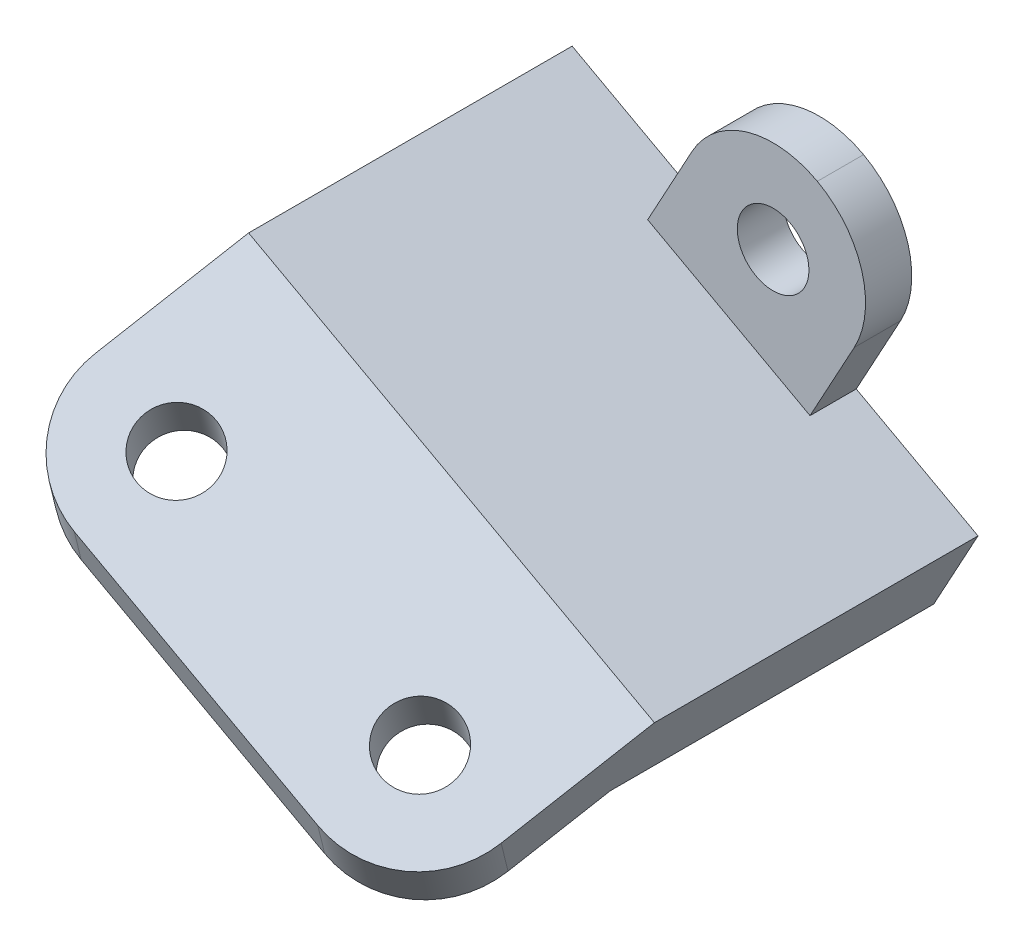
ISO-10303-21;
HEADER;
FILE_DESCRIPTION(('STEP AP214'),'2;1');
FILE_NAME('part.step','',(''),(''),'','','');
FILE_SCHEMA(('AUTOMOTIVE_DESIGN { 1 0 10303 214 1 1 1 1 }'));
ENDSEC;
DATA;
#1=APPLICATION_CONTEXT('core data for automotive mechanical design processes');
#2=APPLICATION_PROTOCOL_DEFINITION('international standard','automotive_design',2000,#1);
#3=PRODUCT_CONTEXT('',#1,'mechanical');
#4=PRODUCT('Part','Part','',(#3));
#5=PRODUCT_RELATED_PRODUCT_CATEGORY('part','',(#4));
#6=PRODUCT_DEFINITION_FORMATION('','',#4);
#7=PRODUCT_DEFINITION_CONTEXT('part definition',#1,'design');
#8=PRODUCT_DEFINITION('design','',#6,#7);
#9=PRODUCT_DEFINITION_SHAPE('','',#8);
#10=(LENGTH_UNIT() NAMED_UNIT(*) SI_UNIT(.MILLI.,.METRE.));
#11=(NAMED_UNIT(*) PLANE_ANGLE_UNIT() SI_UNIT($,.RADIAN.));
#12=(NAMED_UNIT(*) SI_UNIT($,.STERADIAN.) SOLID_ANGLE_UNIT());
#13=UNCERTAINTY_MEASURE_WITH_UNIT(LENGTH_MEASURE(1.E-05),#10,'distance_accuracy_value','');
#14=(GEOMETRIC_REPRESENTATION_CONTEXT(3) GLOBAL_UNCERTAINTY_ASSIGNED_CONTEXT((#13)) GLOBAL_UNIT_ASSIGNED_CONTEXT((#10,
#11,#12)) REPRESENTATION_CONTEXT('',''));
#15=CARTESIAN_POINT('',(0.,0.,0.));
#16=DIRECTION('',(0.,0.,1.));
#17=DIRECTION('',(1.,0.,0.));
#18=AXIS2_PLACEMENT_3D('',#15,#16,#17);
#19=CARTESIAN_POINT('',(53.4032280236198,101.07429996986,2.));
#20=DIRECTION('',(0.878015360581156,-0.478632454586546,0.));
#21=DIRECTION('',(0.478632454586546,0.878015360581156,0.));
#22=AXIS2_PLACEMENT_3D('',#19,#20,#21);
#23=PLANE('',#22);
#24=DIRECTION('',(-0.478632454586546,-0.878015360581156,0.));
#25=VECTOR('',#24,1.);
#26=CARTESIAN_POINT('',(53.4032280236198,101.07429996986,0.));
#27=LINE('',#26,#25);
#28=CARTESIAN_POINT('',(61.0613472970046,115.122545739158,0.));
#29=VERTEX_POINT('',#28);
#30=CARTESIAN_POINT('',(59.1468174786584,111.610484296834,0.));
#31=VERTEX_POINT('',#30);
#32=EDGE_CURVE('E253',#29,#31,#27,.T.);
#33=ORIENTED_EDGE('',*,*,#32,.T.);
#34=DIRECTION('',(0.,0.,1.));
#35=VECTOR('',#34,1.);
#36=CARTESIAN_POINT('',(59.1468174786584,111.610484296834,2.));
#37=LINE('',#36,#35);
#38=CARTESIAN_POINT('',(59.1468174786584,111.610484296834,2.));
#39=VERTEX_POINT('',#38);
#40=EDGE_CURVE('E228',#31,#39,#37,.T.);
#41=ORIENTED_EDGE('',*,*,#40,.T.);
#42=DIRECTION('',(-0.478632454586546,-0.878015360581156,0.));
#43=VECTOR('',#42,1.);
#44=CARTESIAN_POINT('',(53.4032280236198,101.07429996986,2.));
#45=LINE('',#44,#43);
#46=CARTESIAN_POINT('',(61.0613472970046,115.122545739158,2.));
#47=VERTEX_POINT('',#46);
#48=EDGE_CURVE('E244',#47,#39,#45,.T.);
#49=ORIENTED_EDGE('',*,*,#48,.F.);
#50=DIRECTION('',(0.,0.,-1.));
#51=VECTOR('',#50,1.);
#52=CARTESIAN_POINT('',(61.0613472970046,115.122545739158,2.));
#53=LINE('',#52,#51);
#54=EDGE_CURVE('E284',#47,#29,#53,.T.);
#55=ORIENTED_EDGE('',*,*,#54,.T.);
#56=EDGE_LOOP('',(#33,#41,#49,#55));
#57=FACE_BOUND('',#56,.T.);
#58=ADVANCED_FACE('F34',(#57),#23,.F.);
#59=CARTESIAN_POINT('',(70.,114.80554754479,2.));
#60=DIRECTION('',(-0.878015360581156,0.478632454586546,0.));
#61=DIRECTION('',(-0.478632454586546,-0.878015360581156,0.));
#62=AXIS2_PLACEMENT_3D('',#59,#60,#61);
#63=PLANE('',#62);
#64=DIRECTION('',(0.478632454586546,0.878015360581156,0.));
#65=VECTOR('',#64,1.);
#66=CARTESIAN_POINT('',(70.,114.80554754479,2.));
#67=LINE('',#66,#65);
#68=CARTESIAN_POINT('',(66.1709403633076,107.781424660141,2.));
#69=VERTEX_POINT('',#68);
#70=CARTESIAN_POINT('',(68.0854701816538,111.293486102466,2.));
#71=VERTEX_POINT('',#70);
#72=EDGE_CURVE('E247',#69,#71,#67,.T.);
#73=ORIENTED_EDGE('',*,*,#72,.F.);
#74=DIRECTION('',(0.,0.,-1.));
#75=VECTOR('',#74,1.);
#76=CARTESIAN_POINT('',(66.1709403633076,107.781424660141,2.));
#77=LINE('',#76,#75);
#78=CARTESIAN_POINT('',(66.1709403633076,107.781424660141,0.));
#79=VERTEX_POINT('',#78);
#80=EDGE_CURVE('E225',#69,#79,#77,.T.);
#81=ORIENTED_EDGE('',*,*,#80,.T.);
#82=DIRECTION('',(0.478632454586546,0.878015360581156,0.));
#83=VECTOR('',#82,1.);
#84=CARTESIAN_POINT('',(70.,114.80554754479,0.));
#85=LINE('',#84,#83);
#86=CARTESIAN_POINT('',(68.0854701816538,111.293486102466,0.));
#87=VERTEX_POINT('',#86);
#88=EDGE_CURVE('E256',#79,#87,#85,.T.);
#89=ORIENTED_EDGE('',*,*,#88,.T.);
#90=DIRECTION('',(0.,0.,-1.));
#91=VECTOR('',#90,1.);
#92=CARTESIAN_POINT('',(68.0854701816538,111.293486102466,2.));
#93=LINE('',#92,#91);
#94=EDGE_CURVE('E252',#87,#71,#93,.F.);
#95=ORIENTED_EDGE('',*,*,#94,.T.);
#96=EDGE_LOOP('',(#73,#81,#89,#95));
#97=FACE_BOUND('',#96,.T.);
#98=ADVANCED_FACE('F330',(#97),#63,.F.);
#99=CARTESIAN_POINT('',(0.,0.,2.));
#100=DIRECTION('',(0.,0.,-1.));
#101=DIRECTION('',(-1.,0.,0.));
#102=AXIS2_PLACEMENT_3D('',#99,#100,#101);
#103=PLANE('',#102);
#104=CARTESIAN_POINT('',(64.5734087393292,113.208015920812,2.));
#105=DIRECTION('',(0.,0.,1.));
#106=DIRECTION('',(1.,0.,0.));
#107=AXIS2_PLACEMENT_3D('',#104,#105,#106);
#108=CIRCLE('',#107,1.54999999999999);
#109=CARTESIAN_POINT('',(66.1234087393292,113.208015920812,2.));
#110=VERTEX_POINT('',#109);
#111=EDGE_CURVE('E238',#110,#110,#108,.T.);
#112=ORIENTED_EDGE('',*,*,#111,.F.);
#113=EDGE_LOOP('',(#112));
#114=FACE_BOUND('',#113,.T.);
#115=ORIENTED_EDGE('',*,*,#48,.T.);
#116=DIRECTION('',(0.878015360581156,-0.478632454586546,0.));
#117=VECTOR('',#116,1.);
#118=CARTESIAN_POINT('',(60.4538186597738,110.89799883069,2.));
#119=LINE('',#118,#117);
#120=EDGE_CURVE('E222',#39,#69,#119,.T.);
#121=ORIENTED_EDGE('',*,*,#120,.T.);
#122=ORIENTED_EDGE('',*,*,#72,.T.);
#123=CARTESIAN_POINT('',(64.5734087393292,113.208015920812,2.));
#124=DIRECTION('',(0.,0.,-1.));
#125=DIRECTION('',(-1.,0.,0.));
#126=AXIS2_PLACEMENT_3D('',#123,#124,#125);
#127=CIRCLE('',#126,4.);
#128=CARTESIAN_POINT('',(66.4879385576754,116.720077363137,2.));
#129=VERTEX_POINT('',#128);
#130=EDGE_CURVE('E278',#71,#129,#127,.F.);
#131=ORIENTED_EDGE('',*,*,#130,.T.);
#132=CARTESIAN_POINT('',(64.5734087393292,113.208015920812,2.));
#133=DIRECTION('',(0.,0.,-1.));
#134=DIRECTION('',(-1.,0.,0.));
#135=AXIS2_PLACEMENT_3D('',#132,#133,#134);
#136=CIRCLE('',#135,4.);
#137=EDGE_CURVE('E276',#129,#47,#136,.F.);
#138=ORIENTED_EDGE('',*,*,#137,.T.);
#139=EDGE_LOOP('',(#115,#121,#122,#131,#138));
#140=FACE_BOUND('',#139,.T.);
#141=ADVANCED_FACE('F334',(#114,#140),#103,.F.);
#142=CARTESIAN_POINT('',(57.2322876603122,108.098422854509,2.));
#143=VERTEX_POINT('',#142);
#144=CARTESIAN_POINT('',(55.317757841966,104.586361412184,2.));
#145=VERTEX_POINT('',#144);
#146=EDGE_CURVE('E248',#143,#145,#45,.T.);
#147=ORIENTED_EDGE('',*,*,#146,.F.);
#148=DIRECTION('',(0.,0.,-1.));
#149=VECTOR('',#148,1.);
#150=CARTESIAN_POINT('',(57.2322876603122,108.098422854509,2.));
#151=LINE('',#150,#149);
#152=CARTESIAN_POINT('',(57.2322876603122,108.098422854509,0.));
#153=VERTEX_POINT('',#152);
#154=EDGE_CURVE('E219',#143,#153,#151,.T.);
#155=ORIENTED_EDGE('',*,*,#154,.T.);
#156=CARTESIAN_POINT('',(55.317757841966,104.586361412184,0.));
#157=VERTEX_POINT('',#156);
#158=EDGE_CURVE('E257',#153,#157,#27,.T.);
#159=ORIENTED_EDGE('',*,*,#158,.T.);
#160=DIRECTION('',(0.,0.,-1.));
#161=VECTOR('',#160,1.);
#162=CARTESIAN_POINT('',(55.317757841966,104.586361412184,2.));
#163=LINE('',#162,#161);
#164=EDGE_CURVE('E286',#157,#145,#163,.F.);
#165=ORIENTED_EDGE('',*,*,#164,.T.);
#166=EDGE_LOOP('',(#147,#155,#159,#165));
#167=FACE_BOUND('',#166,.T.);
#168=ADVANCED_FACE('F384',(#167),#23,.F.);
#169=CARTESIAN_POINT('',(62.3418807266152,100.757301775492,0.));
#170=VERTEX_POINT('',#169);
#171=CARTESIAN_POINT('',(64.2564105449614,104.269363217817,0.));
#172=VERTEX_POINT('',#171);
#173=EDGE_CURVE('E258',#170,#172,#85,.T.);
#174=ORIENTED_EDGE('',*,*,#173,.T.);
#175=DIRECTION('',(0.,0.,1.));
#176=VECTOR('',#175,1.);
#177=CARTESIAN_POINT('',(64.2564105449614,104.269363217817,2.));
#178=LINE('',#177,#176);
#179=CARTESIAN_POINT('',(64.2564105449614,104.269363217817,2.));
#180=VERTEX_POINT('',#179);
#181=EDGE_CURVE('E216',#172,#180,#178,.T.);
#182=ORIENTED_EDGE('',*,*,#181,.T.);
#183=CARTESIAN_POINT('',(62.3418807266152,100.757301775492,2.));
#184=VERTEX_POINT('',#183);
#185=EDGE_CURVE('E249',#184,#180,#67,.T.);
#186=ORIENTED_EDGE('',*,*,#185,.F.);
#187=DIRECTION('',(0.,0.,-1.));
#188=VECTOR('',#187,1.);
#189=CARTESIAN_POINT('',(62.3418807266152,100.757301775492,2.));
#190=LINE('',#189,#188);
#191=EDGE_CURVE('E263',#184,#170,#190,.T.);
#192=ORIENTED_EDGE('',*,*,#191,.T.);
#193=EDGE_LOOP('',(#174,#182,#186,#192));
#194=FACE_BOUND('',#193,.T.);
#195=ADVANCED_FACE('F389',(#194),#63,.F.);
#196=CARTESIAN_POINT('',(58.8298192842906,102.671831593838,2.));
#197=DIRECTION('',(0.,0.,1.));
#198=DIRECTION('',(1.,0.,0.));
#199=AXIS2_PLACEMENT_3D('',#196,#197,#198);
#200=CIRCLE('',#199,1.55);
#201=CARTESIAN_POINT('',(60.3798192842906,102.671831593838,2.));
#202=VERTEX_POINT('',#201);
#203=EDGE_CURVE('E232',#202,#202,#200,.T.);
#204=ORIENTED_EDGE('',*,*,#203,.F.);
#205=EDGE_LOOP('',(#204));
#206=FACE_BOUND('',#205,.T.);
#207=ORIENTED_EDGE('',*,*,#185,.T.);
#208=DIRECTION('',(-0.878015360581156,0.478632454586547,0.));
#209=VECTOR('',#208,1.);
#210=CARTESIAN_POINT('',(58.5392888414276,107.385937388365,2.));
#211=LINE('',#210,#209);
#212=EDGE_CURVE('E179',#180,#143,#211,.T.);
#213=ORIENTED_EDGE('',*,*,#212,.T.);
#214=ORIENTED_EDGE('',*,*,#146,.T.);
#215=CARTESIAN_POINT('',(58.8298192842906,102.671831593838,2.));
#216=DIRECTION('',(0.,0.,-1.));
#217=DIRECTION('',(-1.,0.,0.));
#218=AXIS2_PLACEMENT_3D('',#215,#216,#217);
#219=CIRCLE('',#218,4.);
#220=CARTESIAN_POINT('',(56.9152894659444,99.1597701515135,2.));
#221=VERTEX_POINT('',#220);
#222=EDGE_CURVE('E280',#145,#221,#219,.F.);
#223=ORIENTED_EDGE('',*,*,#222,.T.);
#224=CARTESIAN_POINT('',(58.8298192842906,102.671831593838,2.));
#225=DIRECTION('',(0.,0.,-1.));
#226=DIRECTION('',(-1.,0.,0.));
#227=AXIS2_PLACEMENT_3D('',#224,#225,#226);
#228=CIRCLE('',#227,4.);
#229=EDGE_CURVE('E282',#221,#184,#228,.F.);
#230=ORIENTED_EDGE('',*,*,#229,.T.);
#231=EDGE_LOOP('',(#207,#213,#214,#223,#230));
#232=FACE_BOUND('',#231,.T.);
#233=ADVANCED_FACE('F397',(#206,#232),#103,.F.);
#234=CARTESIAN_POINT('',(0.,0.,0.));
#235=DIRECTION('',(0.,0.,-1.));
#236=DIRECTION('',(-1.,0.,0.));
#237=AXIS2_PLACEMENT_3D('',#234,#235,#236);
#238=PLANE('',#237);
#239=ORIENTED_EDGE('',*,*,#158,.F.);
#240=DIRECTION('',(0.878015360581156,-0.478632454586547,0.));
#241=VECTOR('',#240,1.);
#242=CARTESIAN_POINT('',(64.2564105449614,104.269363217817,0.));
#243=LINE('',#242,#241);
#244=CARTESIAN_POINT('',(51.9641954968253,110.970217582028,0.));
#245=VERTEX_POINT('',#244);
#246=EDGE_CURVE('E204',#245,#153,#243,.T.);
#247=ORIENTED_EDGE('',*,*,#246,.F.);
#248=DIRECTION('',(-0.478632454586541,-0.878015360581159,0.));
#249=VECTOR('',#248,1.);
#250=CARTESIAN_POINT('',(53.8787253151714,114.482279024353,0.));
#251=LINE('',#250,#249);
#252=CARTESIAN_POINT('',(53.8787253151714,114.482279024353,0.));
#253=VERTEX_POINT('',#252);
#254=EDGE_CURVE('E207',#253,#245,#251,.T.);
#255=ORIENTED_EDGE('',*,*,#254,.F.);
#256=DIRECTION('',(-0.878015360581156,0.478632454586546,0.));
#257=VECTOR('',#256,1.);
#258=CARTESIAN_POINT('',(59.1468174786584,111.610484296834,0.));
#259=LINE('',#258,#257);
#260=EDGE_CURVE('E199',#31,#253,#259,.T.);
#261=ORIENTED_EDGE('',*,*,#260,.F.);
#262=ORIENTED_EDGE('',*,*,#32,.F.);
#263=CARTESIAN_POINT('',(64.5734087393292,113.208015920812,0.));
#264=DIRECTION('',(0.,0.,-1.));
#265=DIRECTION('',(-1.,0.,0.));
#266=AXIS2_PLACEMENT_3D('',#263,#264,#265);
#267=CIRCLE('',#266,4.);
#268=CARTESIAN_POINT('',(66.4879385576754,116.720077363137,0.));
#269=VERTEX_POINT('',#268);
#270=EDGE_CURVE('E266',#29,#269,#267,.T.);
#271=ORIENTED_EDGE('',*,*,#270,.T.);
#272=CARTESIAN_POINT('',(64.5734087393292,113.208015920812,0.));
#273=DIRECTION('',(0.,0.,-1.));
#274=DIRECTION('',(-1.,0.,0.));
#275=AXIS2_PLACEMENT_3D('',#272,#273,#274);
#276=CIRCLE('',#275,4.);
#277=EDGE_CURVE('E268',#269,#87,#276,.T.);
#278=ORIENTED_EDGE('',*,*,#277,.T.);
#279=ORIENTED_EDGE('',*,*,#88,.F.);
#280=CARTESIAN_POINT('',(71.4390325267945,104.909629932622,0.));
#281=VERTEX_POINT('',#280);
#282=EDGE_CURVE('E200',#281,#79,#259,.T.);
#283=ORIENTED_EDGE('',*,*,#282,.F.);
#284=DIRECTION('',(0.478632454586546,0.878015360581156,0.));
#285=VECTOR('',#284,1.);
#286=CARTESIAN_POINT('',(69.5245027084484,101.397568490297,0.));
#287=LINE('',#286,#285);
#288=CARTESIAN_POINT('',(69.5245027084484,101.397568490297,0.));
#289=VERTEX_POINT('',#288);
#290=EDGE_CURVE('E178',#289,#281,#287,.T.);
#291=ORIENTED_EDGE('',*,*,#290,.F.);
#292=EDGE_CURVE('E206',#172,#289,#243,.T.);
#293=ORIENTED_EDGE('',*,*,#292,.F.);
#294=ORIENTED_EDGE('',*,*,#173,.F.);
#295=CARTESIAN_POINT('',(58.8298192842906,102.671831593838,0.));
#296=DIRECTION('',(0.,0.,-1.));
#297=DIRECTION('',(-1.,0.,0.));
#298=AXIS2_PLACEMENT_3D('',#295,#296,#297);
#299=CIRCLE('',#298,4.);
#300=CARTESIAN_POINT('',(56.9152894659444,99.1597701515135,0.));
#301=VERTEX_POINT('',#300);
#302=EDGE_CURVE('E274',#170,#301,#299,.T.);
#303=ORIENTED_EDGE('',*,*,#302,.T.);
#304=CARTESIAN_POINT('',(58.8298192842906,102.671831593838,0.));
#305=DIRECTION('',(0.,0.,-1.));
#306=DIRECTION('',(-1.,0.,0.));
#307=AXIS2_PLACEMENT_3D('',#304,#305,#306);
#308=CIRCLE('',#307,4.);
#309=EDGE_CURVE('E271',#301,#157,#308,.T.);
#310=ORIENTED_EDGE('',*,*,#309,.T.);
#311=EDGE_LOOP('',(#239,#247,#255,#261,#262,#271,#278,#279,#283,#291,#293,#294,#303,#310));
#312=FACE_BOUND('',#311,.T.);
#313=CARTESIAN_POINT('',(58.8298192842906,102.671831593838,0.));
#314=DIRECTION('',(0.,0.,-1.));
#315=DIRECTION('',(-1.,0.,0.));
#316=AXIS2_PLACEMENT_3D('',#313,#314,#315);
#317=CIRCLE('',#316,1.55);
#318=CARTESIAN_POINT('',(57.2798192842906,102.671831593838,0.));
#319=VERTEX_POINT('',#318);
#320=EDGE_CURVE('E231',#319,#319,#317,.F.);
#321=ORIENTED_EDGE('',*,*,#320,.T.);
#322=EDGE_LOOP('',(#321));
#323=FACE_BOUND('',#322,.T.);
#324=CARTESIAN_POINT('',(64.5734087393292,113.208015920812,0.));
#325=DIRECTION('',(0.,0.,-1.));
#326=DIRECTION('',(-1.,0.,0.));
#327=AXIS2_PLACEMENT_3D('',#324,#325,#326);
#328=CIRCLE('',#327,1.54999999999999);
#329=CARTESIAN_POINT('',(63.0234087393292,113.208015920812,0.));
#330=VERTEX_POINT('',#329);
#331=EDGE_CURVE('E235',#330,#330,#328,.F.);
#332=ORIENTED_EDGE('',*,*,#331,.T.);
#333=EDGE_LOOP('',(#332));
#334=FACE_BOUND('',#333,.T.);
#335=ADVANCED_FACE('F325',(#312,#323,#334),#238,.T.);
#336=CARTESIAN_POINT('',(58.8298192842906,102.671831593838,2.));
#337=DIRECTION('',(0.,0.,-1.));
#338=DIRECTION('',(-1.,0.,0.));
#339=AXIS2_PLACEMENT_3D('',#336,#337,#338);
#340=CYLINDRICAL_SURFACE('',#339,4.);
#341=DIRECTION('',(0.,0.,-1.));
#342=VECTOR('',#341,1.);
#343=CARTESIAN_POINT('',(56.9152894659444,99.1597701515135,2.));
#344=LINE('',#343,#342);
#345=EDGE_CURVE('E290',#221,#301,#344,.T.);
#346=ORIENTED_EDGE('',*,*,#345,.F.);
#347=ORIENTED_EDGE('',*,*,#222,.F.);
#348=ORIENTED_EDGE('',*,*,#164,.F.);
#349=ORIENTED_EDGE('',*,*,#309,.F.);
#350=EDGE_LOOP('',(#346,#347,#348,#349));
#351=FACE_BOUND('',#350,.T.);
#352=ADVANCED_FACE('F411',(#351),#340,.T.);
#353=CARTESIAN_POINT('',(58.8298192842906,102.671831593838,2.));
#354=DIRECTION('',(0.,0.,-1.));
#355=DIRECTION('',(-1.,0.,0.));
#356=AXIS2_PLACEMENT_3D('',#353,#354,#355);
#357=CYLINDRICAL_SURFACE('',#356,4.);
#358=ORIENTED_EDGE('',*,*,#229,.F.);
#359=ORIENTED_EDGE('',*,*,#345,.T.);
#360=ORIENTED_EDGE('',*,*,#302,.F.);
#361=ORIENTED_EDGE('',*,*,#191,.F.);
#362=EDGE_LOOP('',(#358,#359,#360,#361));
#363=FACE_BOUND('',#362,.T.);
#364=ADVANCED_FACE('F413',(#363),#357,.T.);
#365=CARTESIAN_POINT('',(64.5734087393292,113.208015920812,2.));
#366=DIRECTION('',(0.,0.,-1.));
#367=DIRECTION('',(-1.,0.,0.));
#368=AXIS2_PLACEMENT_3D('',#365,#366,#367);
#369=CYLINDRICAL_SURFACE('',#368,4.);
#370=ORIENTED_EDGE('',*,*,#54,.F.);
#371=ORIENTED_EDGE('',*,*,#137,.F.);
#372=DIRECTION('',(0.,0.,-1.));
#373=VECTOR('',#372,1.);
#374=CARTESIAN_POINT('',(66.4879385576754,116.720077363137,2.));
#375=LINE('',#374,#373);
#376=EDGE_CURVE('E241',#269,#129,#375,.F.);
#377=ORIENTED_EDGE('',*,*,#376,.F.);
#378=ORIENTED_EDGE('',*,*,#270,.F.);
#379=EDGE_LOOP('',(#370,#371,#377,#378));
#380=FACE_BOUND('',#379,.T.);
#381=ADVANCED_FACE('F343',(#380),#369,.T.);
#382=CARTESIAN_POINT('',(64.5734087393292,113.208015920812,2.));
#383=DIRECTION('',(0.,0.,-1.));
#384=DIRECTION('',(-1.,0.,0.));
#385=AXIS2_PLACEMENT_3D('',#382,#383,#384);
#386=CYLINDRICAL_SURFACE('',#385,4.);
#387=ORIENTED_EDGE('',*,*,#130,.F.);
#388=ORIENTED_EDGE('',*,*,#94,.F.);
#389=ORIENTED_EDGE('',*,*,#277,.F.);
#390=ORIENTED_EDGE('',*,*,#376,.T.);
#391=EDGE_LOOP('',(#387,#388,#389,#390));
#392=FACE_BOUND('',#391,.T.);
#393=ADVANCED_FACE('F337',(#392),#386,.T.);
#394=CARTESIAN_POINT('',(64.5734087393292,113.208015920812,-0.00100000000000013));
#395=DIRECTION('',(0.,0.,1.));
#396=DIRECTION('',(1.,0.,0.));
#397=AXIS2_PLACEMENT_3D('',#394,#395,#396);
#398=CYLINDRICAL_SURFACE('',#397,1.54999999999999);
#399=ORIENTED_EDGE('',*,*,#331,.F.);
#400=EDGE_LOOP('',(#399));
#401=FACE_BOUND('',#400,.T.);
#402=ORIENTED_EDGE('',*,*,#111,.T.);
#403=EDGE_LOOP('',(#402));
#404=FACE_BOUND('',#403,.T.);
#405=ADVANCED_FACE('F423',(#401,#404),#398,.F.);
#406=CARTESIAN_POINT('',(58.8298192842906,102.671831593838,-0.00100000000000013));
#407=DIRECTION('',(0.,0.,1.));
#408=DIRECTION('',(1.,0.,0.));
#409=AXIS2_PLACEMENT_3D('',#406,#407,#408);
#410=CYLINDRICAL_SURFACE('',#409,1.55);
#411=ORIENTED_EDGE('',*,*,#320,.F.);
#412=EDGE_LOOP('',(#411));
#413=FACE_BOUND('',#412,.T.);
#414=ORIENTED_EDGE('',*,*,#203,.T.);
#415=EDGE_LOOP('',(#414));
#416=FACE_BOUND('',#415,.T.);
#417=ADVANCED_FACE('F490',(#413,#416),#410,.F.);
#418=CARTESIAN_POINT('',(59.1468174786584,111.610484296834,-23.4622873374249));
#419=DIRECTION('',(0.478632454586546,0.878015360581156,0.));
#420=DIRECTION('',(-0.878015360581156,0.478632454586546,0.));
#421=AXIS2_PLACEMENT_3D('',#418,#419,#420);
#422=PLANE('',#421);
#423=ORIENTED_EDGE('',*,*,#40,.F.);
#424=ORIENTED_EDGE('',*,*,#260,.T.);
#425=DIRECTION('',(0.,0.,1.));
#426=VECTOR('',#425,1.);
#427=CARTESIAN_POINT('',(53.8787253151714,114.482279024353,-23.4622873374249));
#428=LINE('',#427,#426);
#429=CARTESIAN_POINT('',(53.8787253151714,114.482279024353,14.));
#430=VERTEX_POINT('',#429);
#431=EDGE_CURVE('E165',#253,#430,#428,.T.);
#432=ORIENTED_EDGE('',*,*,#431,.T.);
#433=DIRECTION('',(-0.878015360581156,0.478632454586547,0.));
#434=VECTOR('',#433,1.);
#435=CARTESIAN_POINT('',(66.1709403633076,107.781424660141,14.));
#436=LINE('',#435,#434);
#437=CARTESIAN_POINT('',(71.4390325267946,104.909629932622,14.));
#438=VERTEX_POINT('',#437);
#439=EDGE_CURVE('E160',#438,#430,#436,.T.);
#440=ORIENTED_EDGE('',*,*,#439,.F.);
#441=DIRECTION('',(0.,0.,1.));
#442=VECTOR('',#441,1.);
#443=CARTESIAN_POINT('',(71.4390325267945,104.909629932622,-23.4622873374249));
#444=LINE('',#443,#442);
#445=EDGE_CURVE('E163',#281,#438,#444,.T.);
#446=ORIENTED_EDGE('',*,*,#445,.F.);
#447=ORIENTED_EDGE('',*,*,#282,.T.);
#448=ORIENTED_EDGE('',*,*,#80,.F.);
#449=ORIENTED_EDGE('',*,*,#120,.F.);
#450=EDGE_LOOP('',(#423,#424,#432,#440,#446,#447,#448,#449));
#451=FACE_BOUND('',#450,.T.);
#452=ADVANCED_FACE('F162',(#451),#422,.T.);
#453=CARTESIAN_POINT('',(64.2564105449614,104.269363217817,-23.4622873374249));
#454=DIRECTION('',(-0.478632454586546,-0.878015360581156,0.));
#455=DIRECTION('',(0.878015360581156,-0.478632454586547,0.));
#456=AXIS2_PLACEMENT_3D('',#453,#454,#455);
#457=PLANE('',#456);
#458=ORIENTED_EDGE('',*,*,#154,.F.);
#459=ORIENTED_EDGE('',*,*,#212,.F.);
#460=ORIENTED_EDGE('',*,*,#181,.F.);
#461=ORIENTED_EDGE('',*,*,#292,.T.);
#462=DIRECTION('',(0.,0.,1.));
#463=VECTOR('',#462,1.);
#464=CARTESIAN_POINT('',(69.5245027084484,101.397568490297,-23.4622873374249));
#465=LINE('',#464,#463);
#466=CARTESIAN_POINT('',(69.5245027084484,101.397568490297,14.));
#467=VERTEX_POINT('',#466);
#468=EDGE_CURVE('E203',#289,#467,#465,.T.);
#469=ORIENTED_EDGE('',*,*,#468,.T.);
#470=DIRECTION('',(0.878015360581156,-0.478632454586547,0.));
#471=VECTOR('',#470,1.);
#472=CARTESIAN_POINT('',(51.9641954968253,110.970217582028,14.));
#473=LINE('',#472,#471);
#474=CARTESIAN_POINT('',(51.9641954968253,110.970217582028,14.));
#475=VERTEX_POINT('',#474);
#476=EDGE_CURVE('E167',#475,#467,#473,.T.);
#477=ORIENTED_EDGE('',*,*,#476,.F.);
#478=DIRECTION('',(0.,0.,1.));
#479=VECTOR('',#478,1.);
#480=CARTESIAN_POINT('',(51.9641954968253,110.970217582028,-23.4622873374249));
#481=LINE('',#480,#479);
#482=EDGE_CURVE('E209',#245,#475,#481,.T.);
#483=ORIENTED_EDGE('',*,*,#482,.F.);
#484=ORIENTED_EDGE('',*,*,#246,.T.);
#485=EDGE_LOOP('',(#458,#459,#460,#461,#469,#477,#483,#484));
#486=FACE_BOUND('',#485,.T.);
#487=ADVANCED_FACE('F320',(#486),#457,.T.);
#488=CARTESIAN_POINT('',(53.8787253151714,114.482279024353,-23.4622873374249));
#489=DIRECTION('',(-0.878015360581159,0.478632454586541,0.));
#490=DIRECTION('',(-0.478632454586541,-0.878015360581159,0.));
#491=AXIS2_PLACEMENT_3D('',#488,#489,#490);
#492=PLANE('',#491);
#493=DIRECTION('',(-0.239316227293269,-0.439007680290578,0.86602540378444));
#494=VECTOR('',#493,1.);
#495=CARTESIAN_POINT('',(40.2309283397022,89.4464184851707,56.4597510264363));
#496=LINE('',#495,#494);
#497=CARTESIAN_POINT('',(51.0069305876522,109.214186860866,17.4641016151378));
#498=VERTEX_POINT('',#497);
#499=EDGE_CURVE('E183',#475,#498,#496,.T.);
#500=ORIENTED_EDGE('',*,*,#499,.T.);
#501=DIRECTION('',(-0.414507864747645,-0.760383607176236,-0.500000000000003));
#502=VECTOR('',#501,1.);
#503=CARTESIAN_POINT('',(52.4428279514118,111.848232942609,19.1961524227067));
#504=LINE('',#503,#502);
#505=CARTESIAN_POINT('',(52.4428279514118,111.848232942609,19.1961524227066));
#506=VERTEX_POINT('',#505);
#507=EDGE_CURVE('E11',#498,#506,#504,.F.);
#508=ORIENTED_EDGE('',*,*,#507,.T.);
#509=DIRECTION('',(-0.239316227293271,-0.43900768029058,0.866025403784438));
#510=VECTOR('',#509,1.);
#511=CARTESIAN_POINT('',(41.6668257034616,92.0804645669138,58.1918018340054));
#512=LINE('',#511,#510);
#513=EDGE_CURVE('E185',#430,#506,#512,.T.);
#514=ORIENTED_EDGE('',*,*,#513,.F.);
#515=ORIENTED_EDGE('',*,*,#431,.F.);
#516=ORIENTED_EDGE('',*,*,#254,.T.);
#517=ORIENTED_EDGE('',*,*,#482,.T.);
#518=EDGE_LOOP('',(#500,#508,#514,#515,#516,#517));
#519=FACE_BOUND('',#518,.T.);
#520=ADVANCED_FACE('F349',(#519),#492,.T.);
#521=CARTESIAN_POINT('',(69.5245027084484,101.397568490297,-23.4622873374249));
#522=DIRECTION('',(0.878015360581156,-0.478632454586546,0.));
#523=DIRECTION('',(0.478632454586546,0.878015360581156,0.));
#524=AXIS2_PLACEMENT_3D('',#521,#522,#523);
#525=PLANE('',#524);
#526=DIRECTION('',(-0.239316227293273,-0.439007680290579,0.866025403784438));
#527=VECTOR('',#526,1.);
#528=CARTESIAN_POINT('',(59.2271329150847,82.5078154751831,58.1918018340053));
#529=LINE('',#528,#527);
#530=CARTESIAN_POINT('',(70.003135163035,102.275583850879,19.1961524227066));
#531=VERTEX_POINT('',#530);
#532=EDGE_CURVE('E168',#438,#531,#529,.T.);
#533=ORIENTED_EDGE('',*,*,#532,.T.);
#534=DIRECTION('',(-0.41450786474765,-0.760383607176234,-0.500000000000003));
#535=VECTOR('',#534,1.);
#536=CARTESIAN_POINT('',(68.5672377992754,99.6415377691351,17.4641016151378));
#537=LINE('',#536,#535);
#538=CARTESIAN_POINT('',(68.5672377992754,99.6415377691351,17.4641016151378));
#539=VERTEX_POINT('',#538);
#540=EDGE_CURVE('E289',#531,#539,#537,.T.);
#541=ORIENTED_EDGE('',*,*,#540,.T.);
#542=DIRECTION('',(-0.239316227293272,-0.439007680290576,0.86602540378444));
#543=VECTOR('',#542,1.);
#544=CARTESIAN_POINT('',(57.7912355513252,79.8737693934399,56.4597510264362));
#545=LINE('',#544,#543);
#546=EDGE_CURVE('E189',#467,#539,#545,.T.);
#547=ORIENTED_EDGE('',*,*,#546,.F.);
#548=ORIENTED_EDGE('',*,*,#468,.F.);
#549=ORIENTED_EDGE('',*,*,#290,.T.);
#550=ORIENTED_EDGE('',*,*,#445,.T.);
#551=EDGE_LOOP('',(#533,#541,#547,#548,#549,#550));
#552=FACE_BOUND('',#551,.T.);
#553=ADVANCED_FACE('F173',(#552),#525,.T.);
#554=CARTESIAN_POINT('',(31.15559963998,6.38037534027963,-35.5315477961612));
#555=DIRECTION('',(0.239316227293272,0.439007680290582,-0.866025403784437));
#556=DIRECTION('',(0.,0.891943793145156,0.452146292553451));
#557=AXIS2_PLACEMENT_3D('',#554,#555,#556);
#558=PLANE('',#557);
#559=DIRECTION('',(-0.878015360581159,0.478632454586541,0.));
#560=VECTOR('',#559,1.);
#561=CARTESIAN_POINT('',(77.9616213242836,92.2425136317874,20.9282032302755));
#562=LINE('',#561,#560);
#563=CARTESIAN_POINT('',(64.0979114477777,99.800036866319,20.9282032302755));
#564=VERTEX_POINT('',#563);
#565=CARTESIAN_POINT('',(53.5617271208038,105.543626321357,20.9282032302755));
#566=VERTEX_POINT('',#565);
#567=EDGE_CURVE('E191',#564,#566,#562,.T.);
#568=ORIENTED_EDGE('',*,*,#567,.F.);
#569=DIRECTION('',(-0.41450786474765,-0.760383607176234,-0.500000000000003));
#570=VECTOR('',#569,1.);
#571=CARTESIAN_POINT('',(65.5338088115373,102.434082948062,22.6602540378444));
#572=LINE('',#571,#570);
#573=CARTESIAN_POINT('',(65.5338088115373,102.434082948062,22.6602540378444));
#574=VERTEX_POINT('',#573);
#575=EDGE_CURVE('E303',#564,#574,#572,.F.);
#576=ORIENTED_EDGE('',*,*,#575,.T.);
#577=DIRECTION('',(-0.878015360581159,0.478632454586541,0.));
#578=VECTOR('',#577,1.);
#579=CARTESIAN_POINT('',(79.3975186880432,94.8765597135309,22.6602540378444));
#580=LINE('',#579,#578);
#581=CARTESIAN_POINT('',(54.9976244845634,108.177672403101,22.6602540378444));
#582=VERTEX_POINT('',#581);
#583=EDGE_CURVE('E194',#574,#582,#580,.T.);
#584=ORIENTED_EDGE('',*,*,#583,.T.);
#585=DIRECTION('',(-0.414507864747645,-0.760383607176236,-0.500000000000003));
#586=VECTOR('',#585,1.);
#587=CARTESIAN_POINT('',(53.5617271208038,105.543626321357,20.9282032302755));
#588=LINE('',#587,#586);
#589=EDGE_CURVE('E300',#582,#566,#588,.T.);
#590=ORIENTED_EDGE('',*,*,#589,.T.);
#591=EDGE_LOOP('',(#568,#576,#584,#590));
#592=FACE_BOUND('',#591,.T.);
#593=ADVANCED_FACE('F308',(#592),#558,.F.);
#594=CARTESIAN_POINT('',(68.1428839855066,74.2307759772545,56.4597510264363));
#595=DIRECTION('',(-0.414507864747647,-0.760383607176239,-0.499999999999998));
#596=DIRECTION('',(0.,0.54942293964704,-0.835544393428383));
#597=AXIS2_PLACEMENT_3D('',#594,#595,#596);
#598=PLANE('',#597);
#599=CARTESIAN_POINT('',(65.0551763569507,101.556067587481,17.4641016151378));
#600=DIRECTION('',(-0.414507864747647,-0.760383607176239,-0.499999999999998));
#601=DIRECTION('',(0.,0.54942293964704,-0.835544393428383));
#602=AXIS2_PLACEMENT_3D('',#599,#600,#601);
#603=CIRCLE('',#602,1.54999999999999);
#604=CARTESIAN_POINT('',(65.0551763569507,102.407673143934,16.1690078053238));
#605=VERTEX_POINT('',#604);
#606=EDGE_CURVE('E357',#605,#605,#603,.F.);
#607=ORIENTED_EDGE('',*,*,#606,.T.);
#608=EDGE_LOOP('',(#607));
#609=FACE_BOUND('',#608,.T.);
#610=CARTESIAN_POINT('',(54.5189920299768,107.29965704252,17.4641016151378));
#611=DIRECTION('',(-0.414507864747647,-0.760383607176239,-0.499999999999998));
#612=DIRECTION('',(0.,0.54942293964704,-0.835544393428383));
#613=AXIS2_PLACEMENT_3D('',#610,#611,#612);
#614=CIRCLE('',#613,1.55000000000001);
#615=CARTESIAN_POINT('',(54.5189920299768,108.151262598973,16.1690078053238));
#616=VERTEX_POINT('',#615);
#617=EDGE_CURVE('E351',#616,#616,#614,.F.);
#618=ORIENTED_EDGE('',*,*,#617,.T.);
#619=EDGE_LOOP('',(#618));
#620=FACE_BOUND('',#619,.T.);
#621=ORIENTED_EDGE('',*,*,#546,.T.);
#622=CARTESIAN_POINT('',(65.0551763569507,101.556067587481,17.4641016151378));
#623=DIRECTION('',(-0.414507864747647,-0.760383607176239,-0.499999999999998));
#624=DIRECTION('',(0.,0.54942293964704,-0.835544393428383));
#625=AXIS2_PLACEMENT_3D('',#622,#623,#624);
#626=CIRCLE('',#625,4.);
#627=EDGE_CURVE('E298',#539,#564,#626,.T.);
#628=ORIENTED_EDGE('',*,*,#627,.T.);
#629=ORIENTED_EDGE('',*,*,#567,.T.);
#630=CARTESIAN_POINT('',(54.5189920299768,107.29965704252,17.4641016151378));
#631=DIRECTION('',(-0.414507864747647,-0.760383607176239,-0.499999999999998));
#632=DIRECTION('',(0.,0.54942293964704,-0.835544393428383));
#633=AXIS2_PLACEMENT_3D('',#630,#631,#632);
#634=CIRCLE('',#633,4.);
#635=EDGE_CURVE('E296',#566,#498,#634,.T.);
#636=ORIENTED_EDGE('',*,*,#635,.T.);
#637=ORIENTED_EDGE('',*,*,#499,.F.);
#638=ORIENTED_EDGE('',*,*,#476,.T.);
#639=EDGE_LOOP('',(#621,#628,#629,#636,#637,#638));
#640=FACE_BOUND('',#639,.T.);
#641=ADVANCED_FACE('F315',(#609,#620,#640),#598,.T.);
#642=CARTESIAN_POINT('',(69.5787813492661,76.8648220589976,58.1918018340054));
#643=DIRECTION('',(-0.414507864747646,-0.760383607176237,-0.500000000000001));
#644=DIRECTION('',(0.,0.549422939647044,-0.835544393428381));
#645=AXIS2_PLACEMENT_3D('',#642,#643,#644);
#646=PLANE('',#645);
#647=CARTESIAN_POINT('',(66.4910737207103,104.190113669225,19.1961524227066));
#648=DIRECTION('',(0.414507864747646,0.760383607176238,0.500000000000001));
#649=DIRECTION('',(0.,-0.549422939647044,0.835544393428381));
#650=AXIS2_PLACEMENT_3D('',#647,#648,#649);
#651=CIRCLE('',#650,1.54999999999999);
#652=CARTESIAN_POINT('',(66.4910737207103,103.338508112772,20.4912462325206));
#653=VERTEX_POINT('',#652);
#654=EDGE_CURVE('E354',#653,#653,#651,.T.);
#655=ORIENTED_EDGE('',*,*,#654,.F.);
#656=EDGE_LOOP('',(#655));
#657=FACE_BOUND('',#656,.T.);
#658=CARTESIAN_POINT('',(55.9548893937364,109.933703124263,19.1961524227066));
#659=DIRECTION('',(0.414507864747646,0.760383607176238,0.500000000000001));
#660=DIRECTION('',(0.,-0.549422939647044,0.835544393428381));
#661=AXIS2_PLACEMENT_3D('',#658,#659,#660);
#662=CIRCLE('',#661,1.55000000000001);
#663=CARTESIAN_POINT('',(55.9548893937364,109.08209756781,20.4912462325206));
#664=VERTEX_POINT('',#663);
#665=EDGE_CURVE('E195',#664,#664,#662,.T.);
#666=ORIENTED_EDGE('',*,*,#665,.F.);
#667=EDGE_LOOP('',(#666));
#668=FACE_BOUND('',#667,.T.);
#669=ORIENTED_EDGE('',*,*,#583,.F.);
#670=CARTESIAN_POINT('',(66.4910737207103,104.190113669225,19.1961524227066));
#671=DIRECTION('',(-0.414507864747646,-0.760383607176237,-0.500000000000001));
#672=DIRECTION('',(0.,0.549422939647044,-0.835544393428381));
#673=AXIS2_PLACEMENT_3D('',#670,#671,#672);
#674=CIRCLE('',#673,4.);
#675=EDGE_CURVE('E42',#574,#531,#674,.F.);
#676=ORIENTED_EDGE('',*,*,#675,.T.);
#677=ORIENTED_EDGE('',*,*,#532,.F.);
#678=ORIENTED_EDGE('',*,*,#439,.T.);
#679=ORIENTED_EDGE('',*,*,#513,.T.);
#680=CARTESIAN_POINT('',(55.9548893937364,109.933703124263,19.1961524227066));
#681=DIRECTION('',(-0.414507864747646,-0.760383607176237,-0.500000000000001));
#682=DIRECTION('',(0.,0.549422939647044,-0.835544393428381));
#683=AXIS2_PLACEMENT_3D('',#680,#681,#682);
#684=CIRCLE('',#683,4.);
#685=EDGE_CURVE('E54',#506,#582,#684,.F.);
#686=ORIENTED_EDGE('',*,*,#685,.T.);
#687=EDGE_LOOP('',(#669,#676,#677,#678,#679,#686));
#688=FACE_BOUND('',#687,.T.);
#689=ADVANCED_FACE('F181',(#657,#668,#688),#646,.F.);
#690=CARTESIAN_POINT('',(57.2909699905512,87.3132129981292,8.09852978078135));
#691=DIRECTION('',(0.41450786474765,0.760383607176234,0.500000000000003));
#692=DIRECTION('',(0.,-0.549422939647047,0.835544393428378));
#693=AXIS2_PLACEMENT_3D('',#690,#691,#692);
#694=CYLINDRICAL_SURFACE('',#693,4.);
#695=ORIENTED_EDGE('',*,*,#675,.F.);
#696=ORIENTED_EDGE('',*,*,#575,.F.);
#697=ORIENTED_EDGE('',*,*,#627,.F.);
#698=ORIENTED_EDGE('',*,*,#540,.F.);
#699=EDGE_LOOP('',(#695,#696,#697,#698));
#700=FACE_BOUND('',#699,.T.);
#701=ADVANCED_FACE('F311',(#700),#694,.T.);
#702=CARTESIAN_POINT('',(7.71297034567324,21.437518751012,-38.995649411299));
#703=DIRECTION('',(0.414507864747645,0.760383607176236,0.500000000000003));
#704=DIRECTION('',(0.,-0.549422939647046,0.835544393428379));
#705=AXIS2_PLACEMENT_3D('',#702,#703,#704);
#706=CYLINDRICAL_SURFACE('',#705,4.);
#707=ORIENTED_EDGE('',*,*,#685,.F.);
#708=ORIENTED_EDGE('',*,*,#507,.F.);
#709=ORIENTED_EDGE('',*,*,#635,.F.);
#710=ORIENTED_EDGE('',*,*,#589,.F.);
#711=EDGE_LOOP('',(#707,#708,#709,#710));
#712=FACE_BOUND('',#711,.T.);
#713=ADVANCED_FACE('F36',(#712),#706,.T.);
#714=CARTESIAN_POINT('',(47.5539885300424,94.5228802050055,9.06256802279601));
#715=DIRECTION('',(0.414507864747646,0.760383607176237,0.500000000000001));
#716=DIRECTION('',(0.,-0.549422939647044,0.835544393428381));
#717=AXIS2_PLACEMENT_3D('',#714,#715,#716);
#718=CYLINDRICAL_SURFACE('',#717,1.55000000000001);
#719=ORIENTED_EDGE('',*,*,#617,.F.);
#720=EDGE_LOOP('',(#719));
#721=FACE_BOUND('',#720,.T.);
#722=ORIENTED_EDGE('',*,*,#665,.T.);
#723=EDGE_LOOP('',(#722));
#724=FACE_BOUND('',#723,.T.);
#725=ADVANCED_FACE('F370',(#721,#724),#718,.F.);
#726=CARTESIAN_POINT('',(58.0901728570163,88.779290749967,9.06256802279601));
#727=DIRECTION('',(0.414507864747646,0.760383607176237,0.500000000000001));
#728=DIRECTION('',(0.,-0.549422939647044,0.835544393428381));
#729=AXIS2_PLACEMENT_3D('',#726,#727,#728);
#730=CYLINDRICAL_SURFACE('',#729,1.54999999999999);
#731=ORIENTED_EDGE('',*,*,#606,.F.);
#732=EDGE_LOOP('',(#731));
#733=FACE_BOUND('',#732,.T.);
#734=ORIENTED_EDGE('',*,*,#654,.T.);
#735=EDGE_LOOP('',(#734));
#736=FACE_BOUND('',#735,.T.);
#737=ADVANCED_FACE('F363',(#733,#736),#730,.F.);
#738=CLOSED_SHELL('',(#58,#98,#141,#168,#195,#233,#335,#352,#364,#381,#393,#405,#417,#452,#487,
#520,#553,#593,#641,#689,#701,#713,#725,#737));
#739=MANIFOLD_SOLID_BREP('B2',#738);
#740=ADVANCED_BREP_SHAPE_REPRESENTATION('',(#18,#739),#14);
#741=SHAPE_DEFINITION_REPRESENTATION(#9,#740);
ENDSEC;
END-ISO-10303-21;
